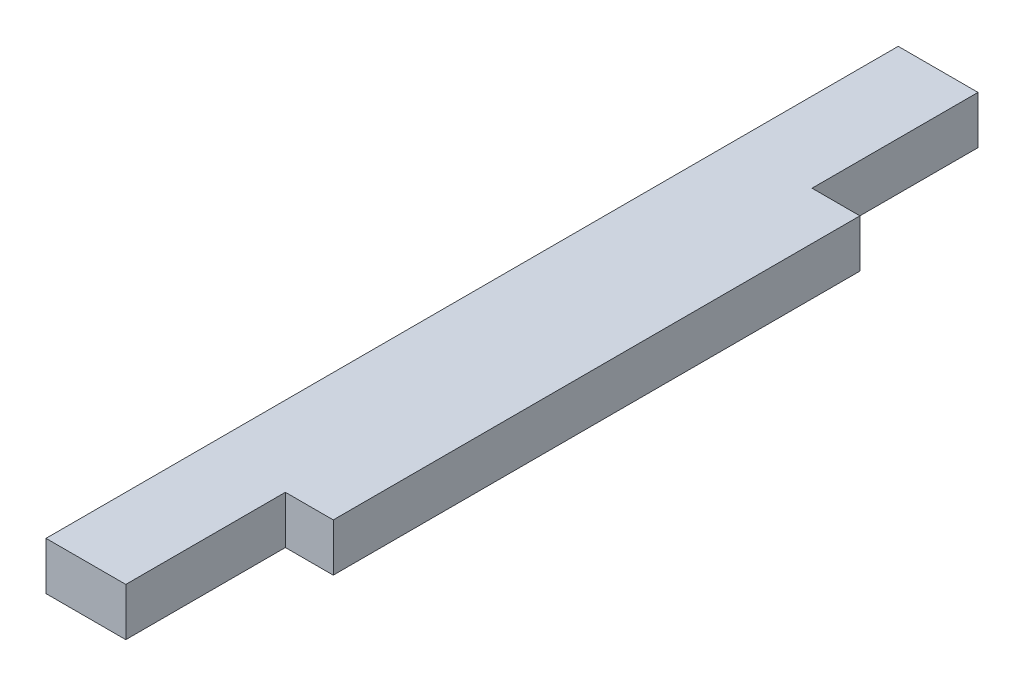
ISO-10303-21;
HEADER;
FILE_DESCRIPTION(('STEP AP214'),'2;1');
FILE_NAME('part.step','',(''),(''),'','','');
FILE_SCHEMA(('AUTOMOTIVE_DESIGN { 1 0 10303 214 1 1 1 1 }'));
ENDSEC;
DATA;
#1=APPLICATION_CONTEXT('core data for automotive mechanical design processes');
#2=APPLICATION_PROTOCOL_DEFINITION('international standard','automotive_design',2000,#1);
#3=PRODUCT_CONTEXT('',#1,'mechanical');
#4=PRODUCT('Part','Part','',(#3));
#5=PRODUCT_RELATED_PRODUCT_CATEGORY('part','',(#4));
#6=PRODUCT_DEFINITION_FORMATION('','',#4);
#7=PRODUCT_DEFINITION_CONTEXT('part definition',#1,'design');
#8=PRODUCT_DEFINITION('design','',#6,#7);
#9=PRODUCT_DEFINITION_SHAPE('','',#8);
#10=(LENGTH_UNIT() NAMED_UNIT(*) SI_UNIT(.MILLI.,.METRE.));
#11=(NAMED_UNIT(*) PLANE_ANGLE_UNIT() SI_UNIT($,.RADIAN.));
#12=(NAMED_UNIT(*) SI_UNIT($,.STERADIAN.) SOLID_ANGLE_UNIT());
#13=UNCERTAINTY_MEASURE_WITH_UNIT(LENGTH_MEASURE(1.E-05),#10,'distance_accuracy_value','');
#14=(GEOMETRIC_REPRESENTATION_CONTEXT(3) GLOBAL_UNCERTAINTY_ASSIGNED_CONTEXT((#13)) GLOBAL_UNIT_ASSIGNED_CONTEXT((#10,
#11,#12)) REPRESENTATION_CONTEXT('',''));
#15=CARTESIAN_POINT('',(0.,0.,0.));
#16=DIRECTION('',(0.,0.,1.));
#17=DIRECTION('',(1.,0.,0.));
#18=AXIS2_PLACEMENT_3D('',#15,#16,#17);
#19=CARTESIAN_POINT('',(108.562592566047,-75.5,59.2309518948453));
#20=DIRECTION('',(-1.,0.,0.));
#21=DIRECTION('',(0.,0.,1.));
#22=AXIS2_PLACEMENT_3D('',#19,#20,#21);
#23=PLANE('',#22);
#24=DIRECTION('',(0.,-1.,0.));
#25=VECTOR('',#24,1.);
#26=CARTESIAN_POINT('',(108.562592566047,-75.5,43.4));
#27=LINE('',#26,#25);
#28=CARTESIAN_POINT('',(108.562592566047,-75.5,43.4));
#29=VERTEX_POINT('',#28);
#30=CARTESIAN_POINT('',(108.562592566047,-78.5,43.4));
#31=VERTEX_POINT('',#30);
#32=EDGE_CURVE('E126',#29,#31,#27,.T.);
#33=ORIENTED_EDGE('',*,*,#32,.F.);
#34=DIRECTION('',(0.,0.,-1.));
#35=VECTOR('',#34,1.);
#36=CARTESIAN_POINT('',(108.562592566047,-75.5,59.2309518948453));
#37=LINE('',#36,#35);
#38=CARTESIAN_POINT('',(108.562592566047,-75.5,53.4));
#39=VERTEX_POINT('',#38);
#40=EDGE_CURVE('E109',#39,#29,#37,.T.);
#41=ORIENTED_EDGE('',*,*,#40,.F.);
#42=DIRECTION('',(0.,-1.,0.));
#43=VECTOR('',#42,1.);
#44=CARTESIAN_POINT('',(108.562592566047,-75.5,53.4));
#45=LINE('',#44,#43);
#46=CARTESIAN_POINT('',(108.562592566047,-78.5,53.4));
#47=VERTEX_POINT('',#46);
#48=EDGE_CURVE('E11',#39,#47,#45,.T.);
#49=ORIENTED_EDGE('',*,*,#48,.T.);
#50=DIRECTION('',(0.,0.,-1.));
#51=VECTOR('',#50,1.);
#52=CARTESIAN_POINT('',(108.562592566047,-78.5,59.2309518948453));
#53=LINE('',#52,#51);
#54=EDGE_CURVE('E60',#47,#31,#53,.T.);
#55=ORIENTED_EDGE('',*,*,#54,.T.);
#56=EDGE_LOOP('',(#33,#41,#49,#55));
#57=FACE_BOUND('',#56,.T.);
#58=ADVANCED_FACE('F37',(#57),#23,.F.);
#59=DIRECTION('',(0.,1.,0.));
#60=VECTOR('',#59,1.);
#61=CARTESIAN_POINT('',(108.562592566047,-75.5,10.4));
#62=LINE('',#61,#60);
#63=CARTESIAN_POINT('',(108.562592566047,-78.5,10.4));
#64=VERTEX_POINT('',#63);
#65=CARTESIAN_POINT('',(108.562592566047,-75.5,10.4));
#66=VERTEX_POINT('',#65);
#67=EDGE_CURVE('E53',#64,#66,#62,.T.);
#68=ORIENTED_EDGE('',*,*,#67,.F.);
#69=CARTESIAN_POINT('',(108.562592566047,-78.5,0.));
#70=VERTEX_POINT('',#69);
#71=EDGE_CURVE('E154',#64,#70,#53,.T.);
#72=ORIENTED_EDGE('',*,*,#71,.T.);
#73=DIRECTION('',(0.,1.,0.));
#74=VECTOR('',#73,1.);
#75=CARTESIAN_POINT('',(108.562592566047,-75.5,0.));
#76=LINE('',#75,#74);
#77=CARTESIAN_POINT('',(108.562592566047,-75.5,0.));
#78=VERTEX_POINT('',#77);
#79=EDGE_CURVE('E105',#70,#78,#76,.T.);
#80=ORIENTED_EDGE('',*,*,#79,.T.);
#81=EDGE_CURVE('E101',#66,#78,#37,.T.);
#82=ORIENTED_EDGE('',*,*,#81,.F.);
#83=EDGE_LOOP('',(#68,#72,#80,#82));
#84=FACE_BOUND('',#83,.T.);
#85=ADVANCED_FACE('F103',(#84),#23,.F.);
#86=CARTESIAN_POINT('',(0.,0.,0.));
#87=DIRECTION('',(0.,0.,-1.));
#88=DIRECTION('',(-1.,0.,0.));
#89=AXIS2_PLACEMENT_3D('',#86,#87,#88);
#90=PLANE('',#89);
#91=ORIENTED_EDGE('',*,*,#79,.F.);
#92=DIRECTION('',(1.,0.,0.));
#93=VECTOR('',#92,1.);
#94=CARTESIAN_POINT('',(108.562592566047,-78.5,0.));
#95=LINE('',#94,#93);
#96=CARTESIAN_POINT('',(103.562592566047,-78.5,0.));
#97=VERTEX_POINT('',#96);
#98=EDGE_CURVE('E151',#97,#70,#95,.T.);
#99=ORIENTED_EDGE('',*,*,#98,.F.);
#100=DIRECTION('',(0.,-1.,0.));
#101=VECTOR('',#100,1.);
#102=CARTESIAN_POINT('',(103.562592566047,-75.5,0.));
#103=LINE('',#102,#101);
#104=CARTESIAN_POINT('',(103.562592566047,-75.5,0.));
#105=VERTEX_POINT('',#104);
#106=EDGE_CURVE('E148',#105,#97,#103,.T.);
#107=ORIENTED_EDGE('',*,*,#106,.F.);
#108=DIRECTION('',(-1.,0.,0.));
#109=VECTOR('',#108,1.);
#110=CARTESIAN_POINT('',(108.562592566047,-75.5,0.));
#111=LINE('',#110,#109);
#112=EDGE_CURVE('E145',#78,#105,#111,.T.);
#113=ORIENTED_EDGE('',*,*,#112,.F.);
#114=EDGE_LOOP('',(#91,#99,#107,#113));
#115=FACE_BOUND('',#114,.T.);
#116=ADVANCED_FACE('F171',(#115),#90,.T.);
#117=CARTESIAN_POINT('',(108.562592566047,-78.5,59.2309518948453));
#118=DIRECTION('',(0.,1.,0.));
#119=DIRECTION('',(0.,0.,1.));
#120=AXIS2_PLACEMENT_3D('',#117,#118,#119);
#121=PLANE('',#120);
#122=ORIENTED_EDGE('',*,*,#54,.F.);
#123=DIRECTION('',(-1.,0.,0.));
#124=VECTOR('',#123,1.);
#125=CARTESIAN_POINT('',(108.562592566047,-78.5,53.4));
#126=LINE('',#125,#124);
#127=CARTESIAN_POINT('',(103.562592566047,-78.5,53.4));
#128=VERTEX_POINT('',#127);
#129=EDGE_CURVE('E40',#47,#128,#126,.T.);
#130=ORIENTED_EDGE('',*,*,#129,.T.);
#131=DIRECTION('',(0.,0.,-1.));
#132=VECTOR('',#131,1.);
#133=CARTESIAN_POINT('',(103.562592566047,-78.5,59.2309518948453));
#134=LINE('',#133,#132);
#135=EDGE_CURVE('E156',#128,#97,#134,.T.);
#136=ORIENTED_EDGE('',*,*,#135,.T.);
#137=ORIENTED_EDGE('',*,*,#98,.T.);
#138=ORIENTED_EDGE('',*,*,#71,.F.);
#139=DIRECTION('',(-1.,0.,0.));
#140=VECTOR('',#139,1.);
#141=CARTESIAN_POINT('',(144.698675617609,-78.5,10.4));
#142=LINE('',#141,#140);
#143=CARTESIAN_POINT('',(111.562592566047,-78.5,10.4));
#144=VERTEX_POINT('',#143);
#145=EDGE_CURVE('E120',#144,#64,#142,.T.);
#146=ORIENTED_EDGE('',*,*,#145,.F.);
#147=DIRECTION('',(0.,0.,1.));
#148=VECTOR('',#147,1.);
#149=CARTESIAN_POINT('',(111.562592566047,-78.5,43.4));
#150=LINE('',#149,#148);
#151=CARTESIAN_POINT('',(111.562592566047,-78.5,43.4));
#152=VERTEX_POINT('',#151);
#153=EDGE_CURVE('E173',#144,#152,#150,.T.);
#154=ORIENTED_EDGE('',*,*,#153,.T.);
#155=DIRECTION('',(-1.,0.,0.));
#156=VECTOR('',#155,1.);
#157=CARTESIAN_POINT('',(144.698675617609,-78.5,43.4));
#158=LINE('',#157,#156);
#159=EDGE_CURVE('E135',#152,#31,#158,.T.);
#160=ORIENTED_EDGE('',*,*,#159,.T.);
#161=EDGE_LOOP('',(#122,#130,#136,#137,#138,#146,#154,#160));
#162=FACE_BOUND('',#161,.T.);
#163=ADVANCED_FACE('F162',(#162),#121,.F.);
#164=CARTESIAN_POINT('',(103.562592566047,-75.5,59.2309518948453));
#165=DIRECTION('',(1.,0.,0.));
#166=DIRECTION('',(0.,1.,0.));
#167=AXIS2_PLACEMENT_3D('',#164,#165,#166);
#168=PLANE('',#167);
#169=ORIENTED_EDGE('',*,*,#135,.F.);
#170=DIRECTION('',(0.,1.,0.));
#171=VECTOR('',#170,1.);
#172=CARTESIAN_POINT('',(103.562592566047,-75.5,53.4));
#173=LINE('',#172,#171);
#174=CARTESIAN_POINT('',(103.562592566047,-75.5,53.4));
#175=VERTEX_POINT('',#174);
#176=EDGE_CURVE('E139',#128,#175,#173,.T.);
#177=ORIENTED_EDGE('',*,*,#176,.T.);
#178=DIRECTION('',(0.,0.,-1.));
#179=VECTOR('',#178,1.);
#180=CARTESIAN_POINT('',(103.562592566047,-75.5,59.2309518948453));
#181=LINE('',#180,#179);
#182=EDGE_CURVE('E110',#175,#105,#181,.T.);
#183=ORIENTED_EDGE('',*,*,#182,.T.);
#184=ORIENTED_EDGE('',*,*,#106,.T.);
#185=EDGE_LOOP('',(#169,#177,#183,#184));
#186=FACE_BOUND('',#185,.T.);
#187=ADVANCED_FACE('F168',(#186),#168,.F.);
#188=CARTESIAN_POINT('',(108.562592566047,-75.5,59.2309518948453));
#189=DIRECTION('',(0.,-1.,0.));
#190=DIRECTION('',(0.,0.,-1.));
#191=AXIS2_PLACEMENT_3D('',#188,#189,#190);
#192=PLANE('',#191);
#193=ORIENTED_EDGE('',*,*,#182,.F.);
#194=DIRECTION('',(1.,0.,0.));
#195=VECTOR('',#194,1.);
#196=CARTESIAN_POINT('',(108.562592566047,-75.5,53.4));
#197=LINE('',#196,#195);
#198=EDGE_CURVE('E45',#175,#39,#197,.T.);
#199=ORIENTED_EDGE('',*,*,#198,.T.);
#200=ORIENTED_EDGE('',*,*,#40,.T.);
#201=DIRECTION('',(-1.,0.,0.));
#202=VECTOR('',#201,1.);
#203=CARTESIAN_POINT('',(144.698675617609,-75.5,43.4));
#204=LINE('',#203,#202);
#205=CARTESIAN_POINT('',(111.562592566047,-75.5,43.4));
#206=VERTEX_POINT('',#205);
#207=EDGE_CURVE('E121',#206,#29,#204,.T.);
#208=ORIENTED_EDGE('',*,*,#207,.F.);
#209=DIRECTION('',(0.,0.,-1.));
#210=VECTOR('',#209,1.);
#211=CARTESIAN_POINT('',(111.562592566047,-75.5,43.4));
#212=LINE('',#211,#210);
#213=CARTESIAN_POINT('',(111.562592566047,-75.5,10.4));
#214=VERTEX_POINT('',#213);
#215=EDGE_CURVE('E117',#206,#214,#212,.T.);
#216=ORIENTED_EDGE('',*,*,#215,.T.);
#217=DIRECTION('',(-1.,0.,0.));
#218=VECTOR('',#217,1.);
#219=CARTESIAN_POINT('',(144.698675617609,-75.5,10.4));
#220=LINE('',#219,#218);
#221=EDGE_CURVE('E113',#214,#66,#220,.T.);
#222=ORIENTED_EDGE('',*,*,#221,.T.);
#223=ORIENTED_EDGE('',*,*,#81,.T.);
#224=ORIENTED_EDGE('',*,*,#112,.T.);
#225=EDGE_LOOP('',(#193,#199,#200,#208,#216,#222,#223,#224));
#226=FACE_BOUND('',#225,.T.);
#227=ADVANCED_FACE('F115',(#226),#192,.F.);
#228=CARTESIAN_POINT('',(111.562592566047,0.,53.4));
#229=DIRECTION('',(0.,0.,-1.));
#230=DIRECTION('',(1.,0.,0.));
#231=AXIS2_PLACEMENT_3D('',#228,#229,#230);
#232=PLANE('',#231);
#233=ORIENTED_EDGE('',*,*,#198,.F.);
#234=ORIENTED_EDGE('',*,*,#176,.F.);
#235=ORIENTED_EDGE('',*,*,#129,.F.);
#236=ORIENTED_EDGE('',*,*,#48,.F.);
#237=EDGE_LOOP('',(#233,#234,#235,#236));
#238=FACE_BOUND('',#237,.T.);
#239=ADVANCED_FACE('F165',(#238),#232,.F.);
#240=CARTESIAN_POINT('',(144.698675617609,-75.5,10.4));
#241=DIRECTION('',(0.,0.,1.));
#242=DIRECTION('',(1.,0.,0.));
#243=AXIS2_PLACEMENT_3D('',#240,#241,#242);
#244=PLANE('',#243);
#245=ORIENTED_EDGE('',*,*,#221,.F.);
#246=DIRECTION('',(0.,-1.,0.));
#247=VECTOR('',#246,1.);
#248=CARTESIAN_POINT('',(111.562592566047,-75.5,10.4));
#249=LINE('',#248,#247);
#250=EDGE_CURVE('E138',#214,#144,#249,.T.);
#251=ORIENTED_EDGE('',*,*,#250,.T.);
#252=ORIENTED_EDGE('',*,*,#145,.T.);
#253=ORIENTED_EDGE('',*,*,#67,.T.);
#254=EDGE_LOOP('',(#245,#251,#252,#253));
#255=FACE_BOUND('',#254,.T.);
#256=ADVANCED_FACE('F124',(#255),#244,.F.);
#257=CARTESIAN_POINT('',(144.698675617609,-75.5,43.4));
#258=DIRECTION('',(0.,0.,-1.));
#259=DIRECTION('',(-1.,0.,0.));
#260=AXIS2_PLACEMENT_3D('',#257,#258,#259);
#261=PLANE('',#260);
#262=ORIENTED_EDGE('',*,*,#159,.F.);
#263=DIRECTION('',(0.,1.,0.));
#264=VECTOR('',#263,1.);
#265=CARTESIAN_POINT('',(111.562592566047,-75.5,43.4));
#266=LINE('',#265,#264);
#267=EDGE_CURVE('E146',#152,#206,#266,.T.);
#268=ORIENTED_EDGE('',*,*,#267,.T.);
#269=ORIENTED_EDGE('',*,*,#207,.T.);
#270=ORIENTED_EDGE('',*,*,#32,.T.);
#271=EDGE_LOOP('',(#262,#268,#269,#270));
#272=FACE_BOUND('',#271,.T.);
#273=ADVANCED_FACE('F180',(#272),#261,.F.);
#274=CARTESIAN_POINT('',(111.562592566047,0.,-18.1355283268753));
#275=DIRECTION('',(-1.,0.,0.));
#276=DIRECTION('',(0.,1.,0.));
#277=AXIS2_PLACEMENT_3D('',#274,#275,#276);
#278=PLANE('',#277);
#279=ORIENTED_EDGE('',*,*,#153,.F.);
#280=ORIENTED_EDGE('',*,*,#250,.F.);
#281=ORIENTED_EDGE('',*,*,#215,.F.);
#282=ORIENTED_EDGE('',*,*,#267,.F.);
#283=EDGE_LOOP('',(#279,#280,#281,#282));
#284=FACE_BOUND('',#283,.T.);
#285=ADVANCED_FACE('F181',(#284),#278,.F.);
#286=CLOSED_SHELL('',(#58,#85,#116,#163,#187,#227,#239,#256,#273,#285));
#287=MANIFOLD_SOLID_BREP('B2',#286);
#288=ADVANCED_BREP_SHAPE_REPRESENTATION('',(#18,#287),#14);
#289=SHAPE_DEFINITION_REPRESENTATION(#9,#288);
ENDSEC;
END-ISO-10303-21;
